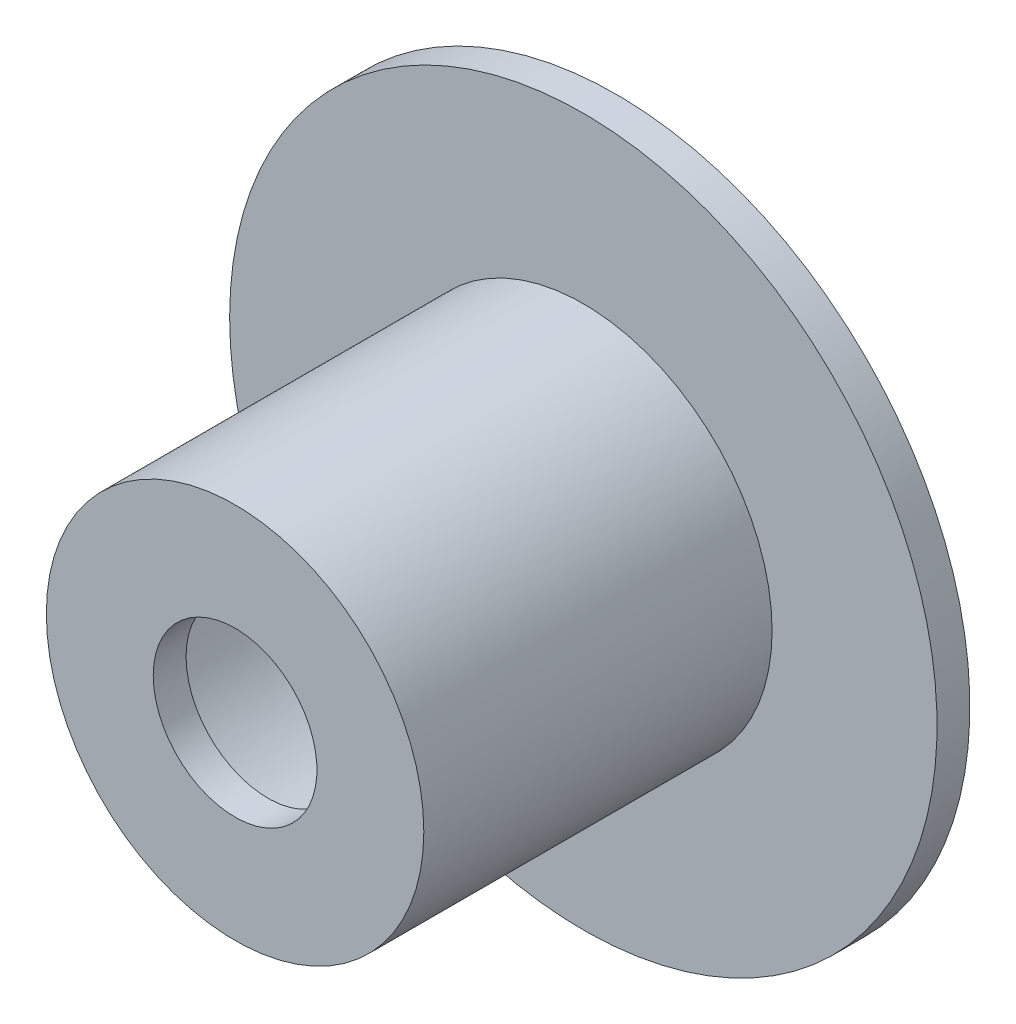
ISO-10303-21;
HEADER;
FILE_DESCRIPTION(('STEP AP214'),'2;1');
FILE_NAME('part.step','',(''),(''),'','','');
FILE_SCHEMA(('AUTOMOTIVE_DESIGN { 1 0 10303 214 1 1 1 1 }'));
ENDSEC;
DATA;
#1=APPLICATION_CONTEXT('core data for automotive mechanical design processes');
#2=APPLICATION_PROTOCOL_DEFINITION('international standard','automotive_design',2000,#1);
#3=PRODUCT_CONTEXT('',#1,'mechanical');
#4=PRODUCT('Part','Part','',(#3));
#5=PRODUCT_RELATED_PRODUCT_CATEGORY('part','',(#4));
#6=PRODUCT_DEFINITION_FORMATION('','',#4);
#7=PRODUCT_DEFINITION_CONTEXT('part definition',#1,'design');
#8=PRODUCT_DEFINITION('design','',#6,#7);
#9=PRODUCT_DEFINITION_SHAPE('','',#8);
#10=(LENGTH_UNIT() NAMED_UNIT(*) SI_UNIT(.MILLI.,.METRE.));
#11=(NAMED_UNIT(*) PLANE_ANGLE_UNIT() SI_UNIT($,.RADIAN.));
#12=(NAMED_UNIT(*) SI_UNIT($,.STERADIAN.) SOLID_ANGLE_UNIT());
#13=UNCERTAINTY_MEASURE_WITH_UNIT(LENGTH_MEASURE(1.E-05),#10,'distance_accuracy_value','');
#14=(GEOMETRIC_REPRESENTATION_CONTEXT(3) GLOBAL_UNCERTAINTY_ASSIGNED_CONTEXT((#13)) GLOBAL_UNIT_ASSIGNED_CONTEXT((#10,
#11,#12)) REPRESENTATION_CONTEXT('',''));
#15=CARTESIAN_POINT('',(0.,0.,0.));
#16=DIRECTION('',(0.,0.,1.));
#17=DIRECTION('',(1.,0.,0.));
#18=AXIS2_PLACEMENT_3D('',#15,#16,#17);
#19=CARTESIAN_POINT('',(259.301545348096,-148.573704322228,-5.));
#20=DIRECTION('',(0.,0.,-1.));
#21=DIRECTION('',(-1.,0.,0.));
#22=AXIS2_PLACEMENT_3D('',#19,#20,#21);
#23=CYLINDRICAL_SURFACE('',#22,9.9745377122126);
#24=CARTESIAN_POINT('',(259.301545348096,-148.573704322228,46.4381804493871));
#25=DIRECTION('',(0.,0.,-1.));
#26=DIRECTION('',(-1.,0.,0.));
#27=AXIS2_PLACEMENT_3D('',#24,#25,#26);
#28=CIRCLE('',#27,9.9745377122126);
#29=CARTESIAN_POINT('',(249.327007635883,-148.573704322228,46.4381804493871));
#30=VERTEX_POINT('',#29);
#31=EDGE_CURVE('E59',#30,#30,#28,.T.);
#32=ORIENTED_EDGE('',*,*,#31,.F.);
#33=EDGE_LOOP('',(#32));
#34=FACE_BOUND('',#33,.T.);
#35=CARTESIAN_POINT('',(259.301545348096,-148.573704322228,42.4381804493871));
#36=DIRECTION('',(0.,0.,-1.));
#37=DIRECTION('',(-1.,0.,0.));
#38=AXIS2_PLACEMENT_3D('',#35,#36,#37);
#39=CIRCLE('',#38,9.9745377122126);
#40=CARTESIAN_POINT('',(249.327007635883,-148.573704322228,42.4381804493871));
#41=VERTEX_POINT('',#40);
#42=EDGE_CURVE('E10',#41,#41,#39,.T.);
#43=ORIENTED_EDGE('',*,*,#42,.T.);
#44=EDGE_LOOP('',(#43));
#45=FACE_BOUND('',#44,.T.);
#46=ADVANCED_FACE('F31',(#34,#45),#23,.F.);
#47=CARTESIAN_POINT('',(259.301545348096,-138.599166610015,42.4381804493871));
#48=DIRECTION('',(0.,0.,1.));
#49=DIRECTION('',(1.,0.,0.));
#50=AXIS2_PLACEMENT_3D('',#47,#48,#49);
#51=PLANE('',#50);
#52=ORIENTED_EDGE('',*,*,#42,.F.);
#53=EDGE_LOOP('',(#52));
#54=FACE_BOUND('',#53,.T.);
#55=CARTESIAN_POINT('',(259.301545348096,-148.573704322228,42.4381804493871));
#56=DIRECTION('',(0.,0.,-1.));
#57=DIRECTION('',(-1.,0.,0.));
#58=AXIS2_PLACEMENT_3D('',#55,#56,#57);
#59=CIRCLE('',#58,20.);
#60=CARTESIAN_POINT('',(239.301545348096,-148.573704322228,42.4381804493871));
#61=VERTEX_POINT('',#60);
#62=EDGE_CURVE('E37',#61,#61,#59,.T.);
#63=ORIENTED_EDGE('',*,*,#62,.T.);
#64=EDGE_LOOP('',(#63));
#65=FACE_BOUND('',#64,.T.);
#66=ADVANCED_FACE('F66',(#54,#65),#51,.F.);
#67=CARTESIAN_POINT('',(259.301545348096,-148.573704322228,-5.));
#68=DIRECTION('',(0.,0.,-1.));
#69=DIRECTION('',(-1.,0.,0.));
#70=AXIS2_PLACEMENT_3D('',#67,#68,#69);
#71=CYLINDRICAL_SURFACE('',#70,20.);
#72=ORIENTED_EDGE('',*,*,#62,.F.);
#73=EDGE_LOOP('',(#72));
#74=FACE_BOUND('',#73,.T.);
#75=CARTESIAN_POINT('',(259.301545348096,-148.573704322228,0.));
#76=DIRECTION('',(0.,0.,-1.));
#77=DIRECTION('',(-1.,0.,0.));
#78=AXIS2_PLACEMENT_3D('',#75,#76,#77);
#79=CIRCLE('',#78,20.);
#80=CARTESIAN_POINT('',(239.301545348096,-148.573704322228,0.));
#81=VERTEX_POINT('',#80);
#82=EDGE_CURVE('E41',#81,#81,#79,.T.);
#83=ORIENTED_EDGE('',*,*,#82,.T.);
#84=EDGE_LOOP('',(#83));
#85=FACE_BOUND('',#84,.T.);
#86=ADVANCED_FACE('F70',(#74,#85),#71,.F.);
#87=CARTESIAN_POINT('',(259.301545348096,-128.573704322228,0.));
#88=DIRECTION('',(0.,0.,1.));
#89=DIRECTION('',(1.,0.,0.));
#90=AXIS2_PLACEMENT_3D('',#87,#88,#89);
#91=PLANE('',#90);
#92=ORIENTED_EDGE('',*,*,#82,.F.);
#93=EDGE_LOOP('',(#92));
#94=FACE_BOUND('',#93,.T.);
#95=CARTESIAN_POINT('',(259.301545348096,-148.573704322228,0.));
#96=DIRECTION('',(0.,0.,-1.));
#97=DIRECTION('',(-1.,0.,0.));
#98=AXIS2_PLACEMENT_3D('',#95,#96,#97);
#99=CIRCLE('',#98,43.10308487204);
#100=CARTESIAN_POINT('',(216.198460476056,-148.573704322228,0.));
#101=VERTEX_POINT('',#100);
#102=EDGE_CURVE('E45',#101,#101,#99,.T.);
#103=ORIENTED_EDGE('',*,*,#102,.T.);
#104=EDGE_LOOP('',(#103));
#105=FACE_BOUND('',#104,.T.);
#106=ADVANCED_FACE('F75',(#94,#105),#91,.F.);
#107=CARTESIAN_POINT('',(259.301545348096,-148.573704322228,-5.));
#108=DIRECTION('',(0.,0.,-1.));
#109=DIRECTION('',(-1.,0.,0.));
#110=AXIS2_PLACEMENT_3D('',#107,#108,#109);
#111=CYLINDRICAL_SURFACE('',#110,43.10308487204);
#112=ORIENTED_EDGE('',*,*,#102,.F.);
#113=EDGE_LOOP('',(#112));
#114=FACE_BOUND('',#113,.T.);
#115=CARTESIAN_POINT('',(259.301545348096,-148.573704322228,4.00000000000003));
#116=DIRECTION('',(0.,0.,-1.));
#117=DIRECTION('',(-1.,0.,0.));
#118=AXIS2_PLACEMENT_3D('',#115,#116,#117);
#119=CIRCLE('',#118,43.10308487204);
#120=CARTESIAN_POINT('',(216.198460476056,-148.573704322228,4.00000000000003));
#121=VERTEX_POINT('',#120);
#122=EDGE_CURVE('E50',#121,#121,#119,.T.);
#123=ORIENTED_EDGE('',*,*,#122,.T.);
#124=EDGE_LOOP('',(#123));
#125=FACE_BOUND('',#124,.T.);
#126=ADVANCED_FACE('F81',(#114,#125),#111,.T.);
#127=CARTESIAN_POINT('',(259.301545348096,-105.470619450187,4.00000000000003));
#128=DIRECTION('',(0.,0.,-1.));
#129=DIRECTION('',(-1.,0.,0.));
#130=AXIS2_PLACEMENT_3D('',#127,#128,#129);
#131=PLANE('',#130);
#132=ORIENTED_EDGE('',*,*,#122,.F.);
#133=EDGE_LOOP('',(#132));
#134=FACE_BOUND('',#133,.T.);
#135=CARTESIAN_POINT('',(259.301545348096,-148.573704322228,4.00000000000003));
#136=DIRECTION('',(0.,0.,-1.));
#137=DIRECTION('',(-1.,0.,0.));
#138=AXIS2_PLACEMENT_3D('',#135,#136,#137);
#139=CIRCLE('',#138,23.);
#140=CARTESIAN_POINT('',(236.301545348096,-148.573704322228,4.00000000000003));
#141=VERTEX_POINT('',#140);
#142=EDGE_CURVE('E53',#141,#141,#139,.T.);
#143=ORIENTED_EDGE('',*,*,#142,.T.);
#144=EDGE_LOOP('',(#143));
#145=FACE_BOUND('',#144,.T.);
#146=ADVANCED_FACE('F85',(#134,#145),#131,.F.);
#147=CARTESIAN_POINT('',(259.301545348096,-148.573704322228,-5.));
#148=DIRECTION('',(0.,0.,-1.));
#149=DIRECTION('',(-1.,0.,0.));
#150=AXIS2_PLACEMENT_3D('',#147,#148,#149);
#151=CYLINDRICAL_SURFACE('',#150,23.);
#152=ORIENTED_EDGE('',*,*,#142,.F.);
#153=EDGE_LOOP('',(#152));
#154=FACE_BOUND('',#153,.T.);
#155=CARTESIAN_POINT('',(259.301545348096,-148.573704322228,46.4381804493871));
#156=DIRECTION('',(0.,0.,-1.));
#157=DIRECTION('',(-1.,0.,0.));
#158=AXIS2_PLACEMENT_3D('',#155,#156,#157);
#159=CIRCLE('',#158,23.);
#160=CARTESIAN_POINT('',(236.301545348096,-148.573704322228,46.4381804493871));
#161=VERTEX_POINT('',#160);
#162=EDGE_CURVE('E56',#161,#161,#159,.T.);
#163=ORIENTED_EDGE('',*,*,#162,.T.);
#164=EDGE_LOOP('',(#163));
#165=FACE_BOUND('',#164,.T.);
#166=ADVANCED_FACE('F89',(#154,#165),#151,.T.);
#167=CARTESIAN_POINT('',(259.301545348096,-125.573704322228,46.4381804493871));
#168=DIRECTION('',(0.,0.,-1.));
#169=DIRECTION('',(-1.,0.,0.));
#170=AXIS2_PLACEMENT_3D('',#167,#168,#169);
#171=PLANE('',#170);
#172=ORIENTED_EDGE('',*,*,#162,.F.);
#173=EDGE_LOOP('',(#172));
#174=FACE_BOUND('',#173,.T.);
#175=ORIENTED_EDGE('',*,*,#31,.T.);
#176=EDGE_LOOP('',(#175));
#177=FACE_BOUND('',#176,.T.);
#178=ADVANCED_FACE('F63',(#174,#177),#171,.F.);
#179=CLOSED_SHELL('',(#46,#66,#86,#106,#126,#146,#166,#178));
#180=MANIFOLD_SOLID_BREP('B2',#179);
#181=ADVANCED_BREP_SHAPE_REPRESENTATION('',(#18,#180),#14);
#182=SHAPE_DEFINITION_REPRESENTATION(#9,#181);
ENDSEC;
END-ISO-10303-21;
